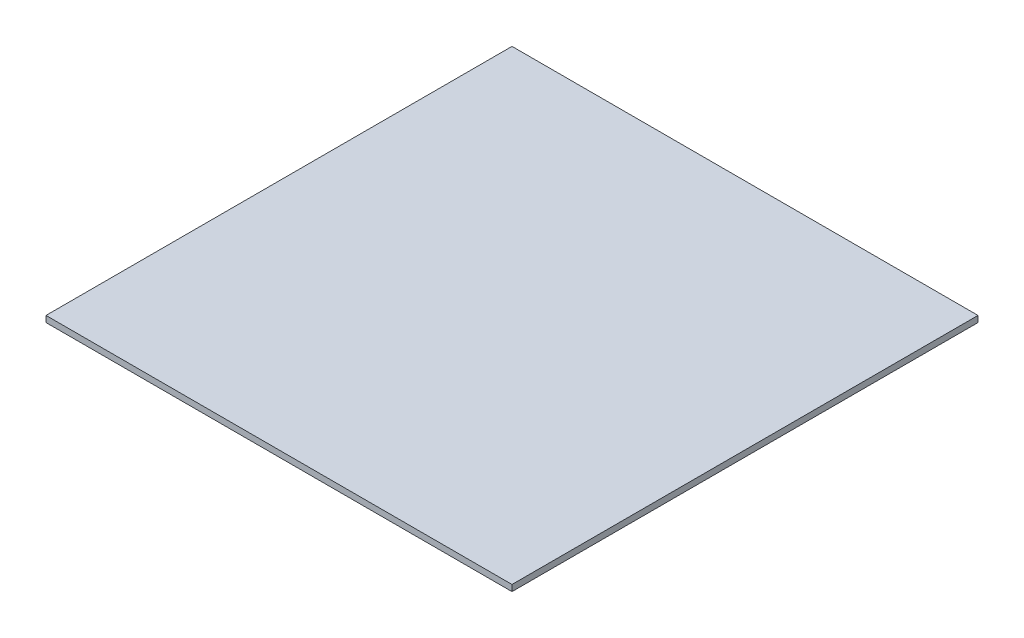
ISO-10303-21;
HEADER;
FILE_DESCRIPTION(('STEP AP214'),'2;1');
FILE_NAME('part.step','',(''),(''),'','','');
FILE_SCHEMA(('AUTOMOTIVE_DESIGN { 1 0 10303 214 1 1 1 1 }'));
ENDSEC;
DATA;
#1=APPLICATION_CONTEXT('core data for automotive mechanical design processes');
#2=APPLICATION_PROTOCOL_DEFINITION('international standard','automotive_design',2000,#1);
#3=PRODUCT_CONTEXT('',#1,'mechanical');
#4=PRODUCT('Part','Part','',(#3));
#5=PRODUCT_RELATED_PRODUCT_CATEGORY('part','',(#4));
#6=PRODUCT_DEFINITION_FORMATION('','',#4);
#7=PRODUCT_DEFINITION_CONTEXT('part definition',#1,'design');
#8=PRODUCT_DEFINITION('design','',#6,#7);
#9=PRODUCT_DEFINITION_SHAPE('','',#8);
#10=(LENGTH_UNIT() NAMED_UNIT(*) SI_UNIT(.MILLI.,.METRE.));
#11=(NAMED_UNIT(*) PLANE_ANGLE_UNIT() SI_UNIT($,.RADIAN.));
#12=(NAMED_UNIT(*) SI_UNIT($,.STERADIAN.) SOLID_ANGLE_UNIT());
#13=UNCERTAINTY_MEASURE_WITH_UNIT(LENGTH_MEASURE(1.E-05),#10,'distance_accuracy_value','');
#14=(GEOMETRIC_REPRESENTATION_CONTEXT(3) GLOBAL_UNCERTAINTY_ASSIGNED_CONTEXT((#13)) GLOBAL_UNIT_ASSIGNED_CONTEXT((#10,
#11,#12)) REPRESENTATION_CONTEXT('',''));
#15=CARTESIAN_POINT('',(0.,0.,0.));
#16=DIRECTION('',(0.,0.,1.));
#17=DIRECTION('',(1.,0.,0.));
#18=AXIS2_PLACEMENT_3D('',#15,#16,#17);
#19=CARTESIAN_POINT('',(-75.,2.,-75.));
#20=DIRECTION('',(1.,0.,0.));
#21=DIRECTION('',(0.,0.,-1.));
#22=AXIS2_PLACEMENT_3D('',#19,#20,#21);
#23=PLANE('',#22);
#24=DIRECTION('',(0.,0.,1.));
#25=VECTOR('',#24,1.);
#26=CARTESIAN_POINT('',(-75.,0.,-75.));
#27=LINE('',#26,#25);
#28=CARTESIAN_POINT('',(-75.,0.,-75.));
#29=VERTEX_POINT('',#28);
#30=CARTESIAN_POINT('',(-75.,0.,75.));
#31=VERTEX_POINT('',#30);
#32=EDGE_CURVE('E95',#29,#31,#27,.T.);
#33=ORIENTED_EDGE('',*,*,#32,.T.);
#34=DIRECTION('',(0.,-1.,0.));
#35=VECTOR('',#34,1.);
#36=CARTESIAN_POINT('',(-75.,2.,75.));
#37=LINE('',#36,#35);
#38=CARTESIAN_POINT('',(-75.,2.,75.));
#39=VERTEX_POINT('',#38);
#40=EDGE_CURVE('E11',#39,#31,#37,.T.);
#41=ORIENTED_EDGE('',*,*,#40,.F.);
#42=DIRECTION('',(0.,0.,1.));
#43=VECTOR('',#42,1.);
#44=CARTESIAN_POINT('',(-75.,2.,-75.));
#45=LINE('',#44,#43);
#46=CARTESIAN_POINT('',(-75.,2.,-75.));
#47=VERTEX_POINT('',#46);
#48=EDGE_CURVE('E83',#47,#39,#45,.T.);
#49=ORIENTED_EDGE('',*,*,#48,.F.);
#50=DIRECTION('',(0.,-1.,0.));
#51=VECTOR('',#50,1.);
#52=CARTESIAN_POINT('',(-75.,2.,-75.));
#53=LINE('',#52,#51);
#54=EDGE_CURVE('E91',#47,#29,#53,.T.);
#55=ORIENTED_EDGE('',*,*,#54,.T.);
#56=EDGE_LOOP('',(#33,#41,#49,#55));
#57=FACE_BOUND('',#56,.T.);
#58=ADVANCED_FACE('F32',(#57),#23,.F.);
#59=CARTESIAN_POINT('',(-75.,2.,75.));
#60=DIRECTION('',(0.,0.,-1.));
#61=DIRECTION('',(-1.,0.,0.));
#62=AXIS2_PLACEMENT_3D('',#59,#60,#61);
#63=PLANE('',#62);
#64=DIRECTION('',(1.,0.,0.));
#65=VECTOR('',#64,1.);
#66=CARTESIAN_POINT('',(-75.,0.,75.));
#67=LINE('',#66,#65);
#68=CARTESIAN_POINT('',(75.,0.,75.));
#69=VERTEX_POINT('',#68);
#70=EDGE_CURVE('E87',#31,#69,#67,.T.);
#71=ORIENTED_EDGE('',*,*,#70,.T.);
#72=DIRECTION('',(0.,-1.,0.));
#73=VECTOR('',#72,1.);
#74=CARTESIAN_POINT('',(75.,2.,75.));
#75=LINE('',#74,#73);
#76=CARTESIAN_POINT('',(75.,2.,75.));
#77=VERTEX_POINT('',#76);
#78=EDGE_CURVE('E40',#77,#69,#75,.T.);
#79=ORIENTED_EDGE('',*,*,#78,.F.);
#80=DIRECTION('',(1.,0.,0.));
#81=VECTOR('',#80,1.);
#82=CARTESIAN_POINT('',(-75.,2.,75.));
#83=LINE('',#82,#81);
#84=EDGE_CURVE('E78',#39,#77,#83,.T.);
#85=ORIENTED_EDGE('',*,*,#84,.F.);
#86=ORIENTED_EDGE('',*,*,#40,.T.);
#87=EDGE_LOOP('',(#71,#79,#85,#86));
#88=FACE_BOUND('',#87,.T.);
#89=ADVANCED_FACE('F86',(#88),#63,.F.);
#90=CARTESIAN_POINT('',(75.,2.,-75.));
#91=DIRECTION('',(-1.,0.,0.));
#92=DIRECTION('',(0.,0.,1.));
#93=AXIS2_PLACEMENT_3D('',#90,#91,#92);
#94=PLANE('',#93);
#95=DIRECTION('',(0.,0.,-1.));
#96=VECTOR('',#95,1.);
#97=CARTESIAN_POINT('',(75.,0.,-75.));
#98=LINE('',#97,#96);
#99=CARTESIAN_POINT('',(75.,0.,-75.));
#100=VERTEX_POINT('',#99);
#101=EDGE_CURVE('E65',#69,#100,#98,.T.);
#102=ORIENTED_EDGE('',*,*,#101,.T.);
#103=DIRECTION('',(0.,-1.,0.));
#104=VECTOR('',#103,1.);
#105=CARTESIAN_POINT('',(75.,2.,-75.));
#106=LINE('',#105,#104);
#107=CARTESIAN_POINT('',(75.,2.,-75.));
#108=VERTEX_POINT('',#107);
#109=EDGE_CURVE('E88',#108,#100,#106,.T.);
#110=ORIENTED_EDGE('',*,*,#109,.F.);
#111=DIRECTION('',(0.,0.,-1.));
#112=VECTOR('',#111,1.);
#113=CARTESIAN_POINT('',(75.,2.,-75.));
#114=LINE('',#113,#112);
#115=EDGE_CURVE('E81',#77,#108,#114,.T.);
#116=ORIENTED_EDGE('',*,*,#115,.F.);
#117=ORIENTED_EDGE('',*,*,#78,.T.);
#118=EDGE_LOOP('',(#102,#110,#116,#117));
#119=FACE_BOUND('',#118,.T.);
#120=ADVANCED_FACE('F89',(#119),#94,.F.);
#121=CARTESIAN_POINT('',(-75.,2.,-75.));
#122=DIRECTION('',(0.,0.,1.));
#123=DIRECTION('',(1.,0.,0.));
#124=AXIS2_PLACEMENT_3D('',#121,#122,#123);
#125=PLANE('',#124);
#126=DIRECTION('',(-1.,0.,0.));
#127=VECTOR('',#126,1.);
#128=CARTESIAN_POINT('',(-75.,0.,-75.));
#129=LINE('',#128,#127);
#130=EDGE_CURVE('E71',#100,#29,#129,.T.);
#131=ORIENTED_EDGE('',*,*,#130,.T.);
#132=ORIENTED_EDGE('',*,*,#54,.F.);
#133=DIRECTION('',(-1.,0.,0.));
#134=VECTOR('',#133,1.);
#135=CARTESIAN_POINT('',(-75.,2.,-75.));
#136=LINE('',#135,#134);
#137=EDGE_CURVE('E48',#108,#47,#136,.T.);
#138=ORIENTED_EDGE('',*,*,#137,.F.);
#139=ORIENTED_EDGE('',*,*,#109,.T.);
#140=EDGE_LOOP('',(#131,#132,#138,#139));
#141=FACE_BOUND('',#140,.T.);
#142=ADVANCED_FACE('F102',(#141),#125,.F.);
#143=CARTESIAN_POINT('',(0.,2.,0.));
#144=DIRECTION('',(0.,1.,0.));
#145=DIRECTION('',(0.,0.,1.));
#146=AXIS2_PLACEMENT_3D('',#143,#144,#145);
#147=PLANE('',#146);
#148=ORIENTED_EDGE('',*,*,#48,.T.);
#149=ORIENTED_EDGE('',*,*,#84,.T.);
#150=ORIENTED_EDGE('',*,*,#115,.T.);
#151=ORIENTED_EDGE('',*,*,#137,.T.);
#152=EDGE_LOOP('',(#148,#149,#150,#151));
#153=FACE_BOUND('',#152,.T.);
#154=ADVANCED_FACE('F79',(#153),#147,.T.);
#155=CARTESIAN_POINT('',(0.,0.,0.));
#156=DIRECTION('',(0.,1.,0.));
#157=DIRECTION('',(0.,0.,1.));
#158=AXIS2_PLACEMENT_3D('',#155,#156,#157);
#159=PLANE('',#158);
#160=ORIENTED_EDGE('',*,*,#32,.F.);
#161=ORIENTED_EDGE('',*,*,#130,.F.);
#162=ORIENTED_EDGE('',*,*,#101,.F.);
#163=ORIENTED_EDGE('',*,*,#70,.F.);
#164=EDGE_LOOP('',(#160,#161,#162,#163));
#165=FACE_BOUND('',#164,.T.);
#166=ADVANCED_FACE('F105',(#165),#159,.F.);
#167=CLOSED_SHELL('',(#58,#89,#120,#142,#154,#166));
#168=MANIFOLD_SOLID_BREP('B2',#167);
#169=ADVANCED_BREP_SHAPE_REPRESENTATION('',(#18,#168),#14);
#170=SHAPE_DEFINITION_REPRESENTATION(#9,#169);
ENDSEC;
END-ISO-10303-21;
